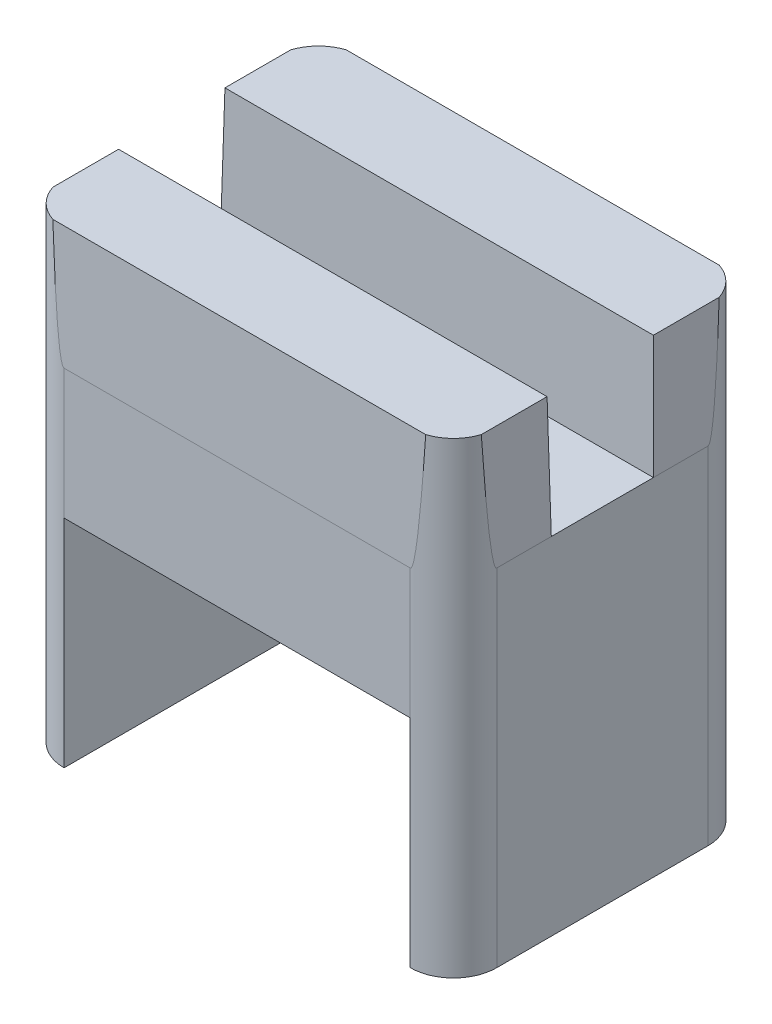
ISO-10303-21;
HEADER;
FILE_DESCRIPTION(('STEP AP214'),'2;1');
FILE_NAME('part.step','',(''),(''),'','','');
FILE_SCHEMA(('AUTOMOTIVE_DESIGN { 1 0 10303 214 1 1 1 1 }'));
ENDSEC;
DATA;
#1=APPLICATION_CONTEXT('core data for automotive mechanical design processes');
#2=APPLICATION_PROTOCOL_DEFINITION('international standard','automotive_design',2000,#1);
#3=PRODUCT_CONTEXT('',#1,'mechanical');
#4=PRODUCT('Part','Part','',(#3));
#5=PRODUCT_RELATED_PRODUCT_CATEGORY('part','',(#4));
#6=PRODUCT_DEFINITION_FORMATION('','',#4);
#7=PRODUCT_DEFINITION_CONTEXT('part definition',#1,'design');
#8=PRODUCT_DEFINITION('design','',#6,#7);
#9=PRODUCT_DEFINITION_SHAPE('','',#8);
#10=(LENGTH_UNIT() NAMED_UNIT(*) SI_UNIT(.MILLI.,.METRE.));
#11=(NAMED_UNIT(*) PLANE_ANGLE_UNIT() SI_UNIT($,.RADIAN.));
#12=(NAMED_UNIT(*) SI_UNIT($,.STERADIAN.) SOLID_ANGLE_UNIT());
#13=UNCERTAINTY_MEASURE_WITH_UNIT(LENGTH_MEASURE(1.E-05),#10,'distance_accuracy_value','');
#14=(GEOMETRIC_REPRESENTATION_CONTEXT(3) GLOBAL_UNCERTAINTY_ASSIGNED_CONTEXT((#13)) GLOBAL_UNIT_ASSIGNED_CONTEXT((#10,
#11,#12)) REPRESENTATION_CONTEXT('',''));
#15=CARTESIAN_POINT('',(0.,0.,0.));
#16=DIRECTION('',(0.,0.,1.));
#17=DIRECTION('',(1.,0.,0.));
#18=AXIS2_PLACEMENT_3D('',#15,#16,#17);
#19=CARTESIAN_POINT('',(0.,40.,34.4));
#20=DIRECTION('',(0.,-1.,0.));
#21=DIRECTION('',(0.,0.,-1.));
#22=AXIS2_PLACEMENT_3D('',#19,#20,#21);
#23=PLANE('',#22);
#24=DIRECTION('',(-1.,0.,0.));
#25=VECTOR('',#24,1.);
#26=CARTESIAN_POINT('',(0.,40.,23.1));
#27=LINE('',#26,#25);
#28=CARTESIAN_POINT('',(50.,40.,23.1));
#29=VERTEX_POINT('',#28);
#30=CARTESIAN_POINT('',(0.,40.,23.1));
#31=VERTEX_POINT('',#30);
#32=EDGE_CURVE('E184',#29,#31,#27,.T.);
#33=ORIENTED_EDGE('',*,*,#32,.F.);
#34=DIRECTION('',(0.,0.,-1.));
#35=VECTOR('',#34,1.);
#36=CARTESIAN_POINT('',(50.,40.,34.4));
#37=LINE('',#36,#35);
#38=CARTESIAN_POINT('',(50.,40.,11.3));
#39=VERTEX_POINT('',#38);
#40=EDGE_CURVE('E246',#29,#39,#37,.T.);
#41=ORIENTED_EDGE('',*,*,#40,.T.);
#42=DIRECTION('',(1.,0.,0.));
#43=VECTOR('',#42,1.);
#44=CARTESIAN_POINT('',(0.,40.,11.3));
#45=LINE('',#44,#43);
#46=CARTESIAN_POINT('',(0.,40.,11.3));
#47=VERTEX_POINT('',#46);
#48=EDGE_CURVE('E200',#47,#39,#45,.T.);
#49=ORIENTED_EDGE('',*,*,#48,.F.);
#50=DIRECTION('',(0.,0.,-1.));
#51=VECTOR('',#50,1.);
#52=CARTESIAN_POINT('',(0.,40.,34.4));
#53=LINE('',#52,#51);
#54=EDGE_CURVE('E235',#31,#47,#53,.T.);
#55=ORIENTED_EDGE('',*,*,#54,.F.);
#56=EDGE_LOOP('',(#33,#41,#49,#55));
#57=FACE_BOUND('',#56,.T.);
#58=ADVANCED_FACE('F41',(#57),#23,.F.);
#59=CARTESIAN_POINT('',(0.,0.,34.4));
#60=DIRECTION('',(1.,0.,0.));
#61=DIRECTION('',(0.,0.,-1.));
#62=AXIS2_PLACEMENT_3D('',#59,#60,#61);
#63=PLANE('',#62);
#64=DIRECTION('',(0.,0.,1.));
#65=VECTOR('',#64,1.);
#66=CARTESIAN_POINT('',(0.,40.,0.));
#67=LINE('',#66,#65);
#68=CARTESIAN_POINT('',(0.,40.,5.));
#69=VERTEX_POINT('',#68);
#70=EDGE_CURVE('E193',#69,#47,#67,.T.);
#71=ORIENTED_EDGE('',*,*,#70,.F.);
#72=DIRECTION('',(0.,-1.,0.));
#73=VECTOR('',#72,1.);
#74=CARTESIAN_POINT('',(0.,0.,5.));
#75=LINE('',#74,#73);
#76=CARTESIAN_POINT('',(0.,0.,5.00000000000001));
#77=VERTEX_POINT('',#76);
#78=EDGE_CURVE('E306',#69,#77,#75,.T.);
#79=ORIENTED_EDGE('',*,*,#78,.T.);
#80=DIRECTION('',(0.,0.,-1.));
#81=VECTOR('',#80,1.);
#82=CARTESIAN_POINT('',(0.,0.,34.4));
#83=LINE('',#82,#81);
#84=CARTESIAN_POINT('',(0.,0.,29.4));
#85=VERTEX_POINT('',#84);
#86=EDGE_CURVE('E264',#85,#77,#83,.T.);
#87=ORIENTED_EDGE('',*,*,#86,.F.);
#88=DIRECTION('',(0.,-1.,0.));
#89=VECTOR('',#88,1.);
#90=CARTESIAN_POINT('',(0.,0.,29.4));
#91=LINE('',#90,#89);
#92=CARTESIAN_POINT('',(0.,40.,29.4));
#93=VERTEX_POINT('',#92);
#94=EDGE_CURVE('E63',#85,#93,#91,.F.);
#95=ORIENTED_EDGE('',*,*,#94,.T.);
#96=EDGE_CURVE('E244',#93,#31,#53,.T.);
#97=ORIENTED_EDGE('',*,*,#96,.T.);
#98=ORIENTED_EDGE('',*,*,#54,.T.);
#99=EDGE_LOOP('',(#71,#79,#87,#95,#97,#98));
#100=FACE_BOUND('',#99,.T.);
#101=ADVANCED_FACE('F360',(#100),#63,.F.);
#102=CARTESIAN_POINT('',(0.,0.,34.4));
#103=DIRECTION('',(0.,1.,0.));
#104=DIRECTION('',(0.,0.,1.));
#105=AXIS2_PLACEMENT_3D('',#102,#103,#104);
#106=PLANE('',#105);
#107=ORIENTED_EDGE('',*,*,#86,.T.);
#108=CARTESIAN_POINT('',(5.,0.,5.));
#109=DIRECTION('',(0.,1.,0.));
#110=DIRECTION('',(0.,0.,1.));
#111=AXIS2_PLACEMENT_3D('',#108,#109,#110);
#112=CIRCLE('',#111,5.);
#113=CARTESIAN_POINT('',(5.,0.,0.));
#114=VERTEX_POINT('',#113);
#115=EDGE_CURVE('E311',#77,#114,#112,.F.);
#116=ORIENTED_EDGE('',*,*,#115,.T.);
#117=DIRECTION('',(0.,0.,-1.));
#118=VECTOR('',#117,1.);
#119=CARTESIAN_POINT('',(5.,0.,34.4));
#120=LINE('',#119,#118);
#121=CARTESIAN_POINT('',(5.,0.,34.4));
#122=VERTEX_POINT('',#121);
#123=EDGE_CURVE('E261',#122,#114,#120,.T.);
#124=ORIENTED_EDGE('',*,*,#123,.F.);
#125=CARTESIAN_POINT('',(5.,0.,29.4));
#126=DIRECTION('',(0.,1.,0.));
#127=DIRECTION('',(0.,0.,1.));
#128=AXIS2_PLACEMENT_3D('',#125,#126,#127);
#129=CIRCLE('',#128,5.);
#130=EDGE_CURVE('E309',#122,#85,#129,.F.);
#131=ORIENTED_EDGE('',*,*,#130,.T.);
#132=EDGE_LOOP('',(#107,#116,#124,#131));
#133=FACE_BOUND('',#132,.T.);
#134=ADVANCED_FACE('F313',(#133),#106,.F.);
#135=CARTESIAN_POINT('',(5.,0.,34.4));
#136=DIRECTION('',(-1.,0.,0.));
#137=DIRECTION('',(0.,0.,1.));
#138=AXIS2_PLACEMENT_3D('',#135,#136,#137);
#139=PLANE('',#138);
#140=DIRECTION('',(0.,1.,0.));
#141=VECTOR('',#140,1.);
#142=CARTESIAN_POINT('',(5.,0.,0.));
#143=LINE('',#142,#141);
#144=CARTESIAN_POINT('',(5.,25.,0.));
#145=VERTEX_POINT('',#144);
#146=EDGE_CURVE('E210',#114,#145,#143,.T.);
#147=ORIENTED_EDGE('',*,*,#146,.T.);
#148=DIRECTION('',(0.,0.,-1.));
#149=VECTOR('',#148,1.);
#150=CARTESIAN_POINT('',(5.,25.,34.4));
#151=LINE('',#150,#149);
#152=CARTESIAN_POINT('',(5.,25.,34.4));
#153=VERTEX_POINT('',#152);
#154=EDGE_CURVE('E258',#153,#145,#151,.T.);
#155=ORIENTED_EDGE('',*,*,#154,.F.);
#156=DIRECTION('',(0.,1.,0.));
#157=VECTOR('',#156,1.);
#158=CARTESIAN_POINT('',(5.,0.,34.4));
#159=LINE('',#158,#157);
#160=EDGE_CURVE('E223',#122,#153,#159,.T.);
#161=ORIENTED_EDGE('',*,*,#160,.F.);
#162=ORIENTED_EDGE('',*,*,#123,.T.);
#163=EDGE_LOOP('',(#147,#155,#161,#162));
#164=FACE_BOUND('',#163,.T.);
#165=ADVANCED_FACE('F319',(#164),#139,.F.);
#166=CARTESIAN_POINT('',(5.,25.,34.4));
#167=DIRECTION('',(0.,1.,0.));
#168=DIRECTION('',(0.,0.,1.));
#169=AXIS2_PLACEMENT_3D('',#166,#167,#168);
#170=PLANE('',#169);
#171=DIRECTION('',(1.,0.,0.));
#172=VECTOR('',#171,1.);
#173=CARTESIAN_POINT('',(5.,25.,0.));
#174=LINE('',#173,#172);
#175=CARTESIAN_POINT('',(45.,25.,0.));
#176=VERTEX_POINT('',#175);
#177=EDGE_CURVE('E237',#145,#176,#174,.T.);
#178=ORIENTED_EDGE('',*,*,#177,.T.);
#179=DIRECTION('',(0.,0.,-1.));
#180=VECTOR('',#179,1.);
#181=CARTESIAN_POINT('',(45.,25.,34.4));
#182=LINE('',#181,#180);
#183=CARTESIAN_POINT('',(45.,25.,34.4));
#184=VERTEX_POINT('',#183);
#185=EDGE_CURVE('E255',#184,#176,#182,.T.);
#186=ORIENTED_EDGE('',*,*,#185,.F.);
#187=DIRECTION('',(1.,0.,0.));
#188=VECTOR('',#187,1.);
#189=CARTESIAN_POINT('',(5.,25.,34.4));
#190=LINE('',#189,#188);
#191=EDGE_CURVE('E225',#153,#184,#190,.T.);
#192=ORIENTED_EDGE('',*,*,#191,.F.);
#193=ORIENTED_EDGE('',*,*,#154,.T.);
#194=EDGE_LOOP('',(#178,#186,#192,#193));
#195=FACE_BOUND('',#194,.T.);
#196=ADVANCED_FACE('F342',(#195),#170,.F.);
#197=CARTESIAN_POINT('',(45.,0.,34.4));
#198=DIRECTION('',(1.,0.,0.));
#199=DIRECTION('',(0.,0.,-1.));
#200=AXIS2_PLACEMENT_3D('',#197,#198,#199);
#201=PLANE('',#200);
#202=DIRECTION('',(0.,-1.,0.));
#203=VECTOR('',#202,1.);
#204=CARTESIAN_POINT('',(45.,0.,0.));
#205=LINE('',#204,#203);
#206=CARTESIAN_POINT('',(45.,0.,0.));
#207=VERTEX_POINT('',#206);
#208=EDGE_CURVE('E240',#176,#207,#205,.T.);
#209=ORIENTED_EDGE('',*,*,#208,.T.);
#210=DIRECTION('',(0.,0.,-1.));
#211=VECTOR('',#210,1.);
#212=CARTESIAN_POINT('',(45.,0.,34.4));
#213=LINE('',#212,#211);
#214=CARTESIAN_POINT('',(45.,0.,34.4));
#215=VERTEX_POINT('',#214);
#216=EDGE_CURVE('E252',#215,#207,#213,.T.);
#217=ORIENTED_EDGE('',*,*,#216,.F.);
#218=DIRECTION('',(0.,-1.,0.));
#219=VECTOR('',#218,1.);
#220=CARTESIAN_POINT('',(45.,0.,34.4));
#221=LINE('',#220,#219);
#222=EDGE_CURVE('E229',#184,#215,#221,.T.);
#223=ORIENTED_EDGE('',*,*,#222,.F.);
#224=ORIENTED_EDGE('',*,*,#185,.T.);
#225=EDGE_LOOP('',(#209,#217,#223,#224));
#226=FACE_BOUND('',#225,.T.);
#227=ADVANCED_FACE('F346',(#226),#201,.F.);
#228=CARTESIAN_POINT('',(45.,0.,34.4));
#229=DIRECTION('',(0.,1.,0.));
#230=DIRECTION('',(0.,0.,1.));
#231=AXIS2_PLACEMENT_3D('',#228,#229,#230);
#232=PLANE('',#231);
#233=DIRECTION('',(0.,0.,-1.));
#234=VECTOR('',#233,1.);
#235=CARTESIAN_POINT('',(50.,0.,34.4));
#236=LINE('',#235,#234);
#237=CARTESIAN_POINT('',(50.,0.,29.4));
#238=VERTEX_POINT('',#237);
#239=CARTESIAN_POINT('',(50.,0.,5.00000000000001));
#240=VERTEX_POINT('',#239);
#241=EDGE_CURVE('E249',#238,#240,#236,.T.);
#242=ORIENTED_EDGE('',*,*,#241,.F.);
#243=CARTESIAN_POINT('',(45.,0.,29.4));
#244=DIRECTION('',(0.,1.,0.));
#245=DIRECTION('',(0.,0.,1.));
#246=AXIS2_PLACEMENT_3D('',#243,#244,#245);
#247=CIRCLE('',#246,5.);
#248=EDGE_CURVE('E289',#238,#215,#247,.F.);
#249=ORIENTED_EDGE('',*,*,#248,.T.);
#250=ORIENTED_EDGE('',*,*,#216,.T.);
#251=CARTESIAN_POINT('',(45.,0.,5.));
#252=DIRECTION('',(0.,1.,0.));
#253=DIRECTION('',(0.,0.,1.));
#254=AXIS2_PLACEMENT_3D('',#251,#252,#253);
#255=CIRCLE('',#254,5.);
#256=EDGE_CURVE('E287',#207,#240,#255,.F.);
#257=ORIENTED_EDGE('',*,*,#256,.T.);
#258=EDGE_LOOP('',(#242,#249,#250,#257));
#259=FACE_BOUND('',#258,.T.);
#260=ADVANCED_FACE('F382',(#259),#232,.F.);
#261=CARTESIAN_POINT('',(50.,0.,34.4));
#262=DIRECTION('',(-1.,0.,0.));
#263=DIRECTION('',(0.,0.,1.));
#264=AXIS2_PLACEMENT_3D('',#261,#262,#263);
#265=PLANE('',#264);
#266=CARTESIAN_POINT('',(50.,40.,29.4));
#267=VERTEX_POINT('',#266);
#268=EDGE_CURVE('E247',#267,#29,#37,.T.);
#269=ORIENTED_EDGE('',*,*,#268,.F.);
#270=DIRECTION('',(0.,1.,0.));
#271=VECTOR('',#270,1.);
#272=CARTESIAN_POINT('',(50.,0.,29.4));
#273=LINE('',#272,#271);
#274=EDGE_CURVE('E285',#267,#238,#273,.F.);
#275=ORIENTED_EDGE('',*,*,#274,.T.);
#276=ORIENTED_EDGE('',*,*,#241,.T.);
#277=DIRECTION('',(0.,1.,0.));
#278=VECTOR('',#277,1.);
#279=CARTESIAN_POINT('',(50.,40.,5.));
#280=LINE('',#279,#278);
#281=CARTESIAN_POINT('',(50.,40.,5.));
#282=VERTEX_POINT('',#281);
#283=EDGE_CURVE('E282',#240,#282,#280,.T.);
#284=ORIENTED_EDGE('',*,*,#283,.T.);
#285=DIRECTION('',(0.,0.,-1.));
#286=VECTOR('',#285,1.);
#287=CARTESIAN_POINT('',(50.,40.,0.));
#288=LINE('',#287,#286);
#289=EDGE_CURVE('E203',#39,#282,#288,.T.);
#290=ORIENTED_EDGE('',*,*,#289,.F.);
#291=ORIENTED_EDGE('',*,*,#40,.F.);
#292=EDGE_LOOP('',(#269,#275,#276,#284,#290,#291));
#293=FACE_BOUND('',#292,.T.);
#294=ADVANCED_FACE('F378',(#293),#265,.F.);
#295=CARTESIAN_POINT('',(0.,0.,34.4));
#296=DIRECTION('',(0.,0.,-1.));
#297=DIRECTION('',(-1.,0.,0.));
#298=AXIS2_PLACEMENT_3D('',#295,#296,#297);
#299=PLANE('',#298);
#300=ORIENTED_EDGE('',*,*,#191,.T.);
#301=DIRECTION('',(0.,1.,0.));
#302=VECTOR('',#301,1.);
#303=CARTESIAN_POINT('',(45.,0.,34.4));
#304=LINE('',#303,#302);
#305=CARTESIAN_POINT('',(45.,40.,34.4));
#306=VERTEX_POINT('',#305);
#307=EDGE_CURVE('E270',#184,#306,#304,.T.);
#308=ORIENTED_EDGE('',*,*,#307,.T.);
#309=DIRECTION('',(-1.,0.,0.));
#310=VECTOR('',#309,1.);
#311=CARTESIAN_POINT('',(0.,40.,34.4));
#312=LINE('',#311,#310);
#313=CARTESIAN_POINT('',(5.,40.,34.4));
#314=VERTEX_POINT('',#313);
#315=EDGE_CURVE('E232',#306,#314,#312,.T.);
#316=ORIENTED_EDGE('',*,*,#315,.T.);
#317=DIRECTION('',(0.,-1.,0.));
#318=VECTOR('',#317,1.);
#319=CARTESIAN_POINT('',(5.,0.,34.4));
#320=LINE('',#319,#318);
#321=EDGE_CURVE('E267',#314,#153,#320,.T.);
#322=ORIENTED_EDGE('',*,*,#321,.T.);
#323=EDGE_LOOP('',(#300,#308,#316,#322));
#324=FACE_BOUND('',#323,.T.);
#325=ADVANCED_FACE('F356',(#324),#299,.F.);
#326=CARTESIAN_POINT('',(0.,0.,0.));
#327=DIRECTION('',(0.,0.,-1.));
#328=DIRECTION('',(-1.,0.,0.));
#329=AXIS2_PLACEMENT_3D('',#326,#327,#328);
#330=PLANE('',#329);
#331=DIRECTION('',(-1.,0.,0.));
#332=VECTOR('',#331,1.);
#333=CARTESIAN_POINT('',(0.,40.,0.));
#334=LINE('',#333,#332);
#335=CARTESIAN_POINT('',(45.,40.,0.));
#336=VERTEX_POINT('',#335);
#337=CARTESIAN_POINT('',(5.,40.,0.));
#338=VERTEX_POINT('',#337);
#339=EDGE_CURVE('E226',#336,#338,#334,.T.);
#340=ORIENTED_EDGE('',*,*,#339,.F.);
#341=DIRECTION('',(0.,1.,0.));
#342=VECTOR('',#341,1.);
#343=CARTESIAN_POINT('',(45.,0.,0.));
#344=LINE('',#343,#342);
#345=EDGE_CURVE('E303',#336,#176,#344,.F.);
#346=ORIENTED_EDGE('',*,*,#345,.T.);
#347=ORIENTED_EDGE('',*,*,#177,.F.);
#348=DIRECTION('',(0.,-1.,0.));
#349=VECTOR('',#348,1.);
#350=CARTESIAN_POINT('',(5.,40.,0.));
#351=LINE('',#350,#349);
#352=EDGE_CURVE('E301',#145,#338,#351,.F.);
#353=ORIENTED_EDGE('',*,*,#352,.T.);
#354=EDGE_LOOP('',(#340,#346,#347,#353));
#355=FACE_BOUND('',#354,.T.);
#356=ADVANCED_FACE('F329',(#355),#330,.T.);
#357=CARTESIAN_POINT('',(0.,40.,0.));
#358=DIRECTION('',(-0.999847695156391,0.0174524064372835,0.));
#359=DIRECTION('',(-0.0174524064372836,-0.999847695156391,0.));
#360=AXIS2_PLACEMENT_3D('',#357,#358,#359);
#361=PLANE('',#360);
#362=DIRECTION('',(0.,0.,-1.));
#363=VECTOR('',#362,1.);
#364=CARTESIAN_POINT('',(0.244370908995047,54.,0.));
#365=LINE('',#364,#363);
#366=CARTESIAN_POINT('',(0.244370908995047,54.,3.45598188197566));
#367=VERTEX_POINT('',#366);
#368=CARTESIAN_POINT('',(0.244370908995048,54.,11.055629091005));
#369=VERTEX_POINT('',#368);
#370=EDGE_CURVE('E206',#367,#369,#365,.F.);
#371=ORIENTED_EDGE('',*,*,#370,.F.);
#372=CARTESIAN_POINT('',(5.,326.449808153796,5.));
#373=DIRECTION('',(-0.999847695156391,0.0174524064372835,0.));
#374=DIRECTION('',(0.0174524064372836,0.999847695156391,0.));
#375=AXIS2_PLACEMENT_3D('',#372,#373,#374);
#376=ELLIPSE('',#375,286.49344249275,5.);
#377=EDGE_CURVE('E49',#367,#69,#376,.T.);
#378=ORIENTED_EDGE('',*,*,#377,.T.);
#379=ORIENTED_EDGE('',*,*,#70,.T.);
#380=DIRECTION('',(-0.0174497491606827,-0.999695459881888,0.0174497491606827));
#381=VECTOR('',#380,1.);
#382=CARTESIAN_POINT('',(0.,40.,11.3));
#383=LINE('',#382,#381);
#384=EDGE_CURVE('E207',#369,#47,#383,.T.);
#385=ORIENTED_EDGE('',*,*,#384,.F.);
#386=EDGE_LOOP('',(#371,#378,#379,#385));
#387=FACE_BOUND('',#386,.T.);
#388=ADVANCED_FACE('F366',(#387),#361,.T.);
#389=CARTESIAN_POINT('',(0.,40.,11.3));
#390=DIRECTION('',(0.,0.0174524064372835,0.999847695156391));
#391=DIRECTION('',(0.,-0.999847695156391,0.0174524064372835));
#392=AXIS2_PLACEMENT_3D('',#389,#390,#391);
#393=PLANE('',#392);
#394=ORIENTED_EDGE('',*,*,#48,.T.);
#395=DIRECTION('',(0.0174497491606827,-0.999695459881888,0.0174497491606827));
#396=VECTOR('',#395,1.);
#397=CARTESIAN_POINT('',(49.9965592206728,40.1971221156357,11.2965592206728));
#398=LINE('',#397,#396);
#399=CARTESIAN_POINT('',(49.755629091005,54.,11.055629091005));
#400=VERTEX_POINT('',#399);
#401=EDGE_CURVE('E211',#400,#39,#398,.T.);
#402=ORIENTED_EDGE('',*,*,#401,.F.);
#403=DIRECTION('',(-1.,0.,0.));
#404=VECTOR('',#403,1.);
#405=CARTESIAN_POINT('',(0.,54.,11.055629091005));
#406=LINE('',#405,#404);
#407=EDGE_CURVE('E216',#369,#400,#406,.F.);
#408=ORIENTED_EDGE('',*,*,#407,.F.);
#409=ORIENTED_EDGE('',*,*,#384,.T.);
#410=EDGE_LOOP('',(#394,#402,#408,#409));
#411=FACE_BOUND('',#410,.T.);
#412=ADVANCED_FACE('F368',(#411),#393,.T.);
#413=CARTESIAN_POINT('',(50.,40.,0.));
#414=DIRECTION('',(0.999847695156391,0.0174524064372835,0.));
#415=DIRECTION('',(-0.0174524064372836,0.999847695156391,0.));
#416=AXIS2_PLACEMENT_3D('',#413,#414,#415);
#417=PLANE('',#416);
#418=ORIENTED_EDGE('',*,*,#289,.T.);
#419=CARTESIAN_POINT('',(45.,326.449808153796,5.));
#420=DIRECTION('',(0.999847695156391,0.0174524064372835,0.));
#421=DIRECTION('',(0.0174524064372836,-0.999847695156391,0.));
#422=AXIS2_PLACEMENT_3D('',#419,#420,#421);
#423=ELLIPSE('',#422,286.49344249275,5.);
#424=CARTESIAN_POINT('',(49.755629091005,54.,3.45598188197566));
#425=VERTEX_POINT('',#424);
#426=EDGE_CURVE('E291',#282,#425,#423,.T.);
#427=ORIENTED_EDGE('',*,*,#426,.T.);
#428=DIRECTION('',(0.,0.,1.));
#429=VECTOR('',#428,1.);
#430=CARTESIAN_POINT('',(49.755629091005,54.,0.));
#431=LINE('',#430,#429);
#432=EDGE_CURVE('E218',#400,#425,#431,.F.);
#433=ORIENTED_EDGE('',*,*,#432,.F.);
#434=ORIENTED_EDGE('',*,*,#401,.T.);
#435=EDGE_LOOP('',(#418,#427,#433,#434));
#436=FACE_BOUND('',#435,.T.);
#437=ADVANCED_FACE('F373',(#436),#417,.T.);
#438=CARTESIAN_POINT('',(0.,40.,0.));
#439=DIRECTION('',(0.,0.0174524064372835,-0.999847695156391));
#440=DIRECTION('',(0.,0.999847695156391,0.0174524064372835));
#441=AXIS2_PLACEMENT_3D('',#438,#439,#440);
#442=PLANE('',#441);
#443=DIRECTION('',(1.,0.,0.));
#444=VECTOR('',#443,1.);
#445=CARTESIAN_POINT('',(0.,54.,0.244370908995047));
#446=LINE('',#445,#444);
#447=CARTESIAN_POINT('',(46.5440181180243,54.,0.244370908995047));
#448=VERTEX_POINT('',#447);
#449=CARTESIAN_POINT('',(3.45598188197567,54.,0.244370908995047));
#450=VERTEX_POINT('',#449);
#451=EDGE_CURVE('E214',#448,#450,#446,.F.);
#452=ORIENTED_EDGE('',*,*,#451,.F.);
#453=CARTESIAN_POINT('',(45.,326.449808153797,5.));
#454=DIRECTION('',(0.,0.0174524064372835,-0.999847695156391));
#455=DIRECTION('',(0.,-0.999847695156391,-0.0174524064372835));
#456=AXIS2_PLACEMENT_3D('',#453,#454,#455);
#457=ELLIPSE('',#456,286.49344249275,5.);
#458=EDGE_CURVE('E299',#448,#336,#457,.T.);
#459=ORIENTED_EDGE('',*,*,#458,.T.);
#460=ORIENTED_EDGE('',*,*,#339,.T.);
#461=CARTESIAN_POINT('',(5.,326.449808153797,5.));
#462=DIRECTION('',(0.,0.0174524064372835,-0.999847695156391));
#463=DIRECTION('',(0.,0.999847695156391,0.0174524064372835));
#464=AXIS2_PLACEMENT_3D('',#461,#462,#463);
#465=ELLIPSE('',#464,286.49344249275,5.);
#466=EDGE_CURVE('E297',#338,#450,#465,.T.);
#467=ORIENTED_EDGE('',*,*,#466,.T.);
#468=EDGE_LOOP('',(#452,#459,#460,#467));
#469=FACE_BOUND('',#468,.T.);
#470=ADVANCED_FACE('F333',(#469),#442,.T.);
#471=CARTESIAN_POINT('',(0.,54.,0.));
#472=DIRECTION('',(0.,1.,0.));
#473=DIRECTION('',(0.,0.,1.));
#474=AXIS2_PLACEMENT_3D('',#471,#472,#473);
#475=PLANE('',#474);
#476=ORIENTED_EDGE('',*,*,#432,.T.);
#477=CARTESIAN_POINT('',(45.,54.,5.));
#478=DIRECTION('',(0.,1.,0.));
#479=DIRECTION('',(0.,0.,1.));
#480=AXIS2_PLACEMENT_3D('',#477,#478,#479);
#481=CIRCLE('',#480,5.);
#482=EDGE_CURVE('E295',#425,#448,#481,.T.);
#483=ORIENTED_EDGE('',*,*,#482,.T.);
#484=ORIENTED_EDGE('',*,*,#451,.T.);
#485=CARTESIAN_POINT('',(5.,54.,5.));
#486=DIRECTION('',(0.,1.,0.));
#487=DIRECTION('',(0.,0.,1.));
#488=AXIS2_PLACEMENT_3D('',#485,#486,#487);
#489=CIRCLE('',#488,5.);
#490=EDGE_CURVE('E293',#450,#367,#489,.T.);
#491=ORIENTED_EDGE('',*,*,#490,.T.);
#492=ORIENTED_EDGE('',*,*,#370,.T.);
#493=ORIENTED_EDGE('',*,*,#407,.T.);
#494=EDGE_LOOP('',(#476,#483,#484,#491,#492,#493));
#495=FACE_BOUND('',#494,.T.);
#496=ADVANCED_FACE('F363',(#495),#475,.T.);
#497=CARTESIAN_POINT('',(0.,40.,34.4));
#498=DIRECTION('',(-0.999847695156391,0.0174524064372835,0.));
#499=DIRECTION('',(-0.0174524064372836,-0.999847695156391,0.));
#500=AXIS2_PLACEMENT_3D('',#497,#498,#499);
#501=PLANE('',#500);
#502=ORIENTED_EDGE('',*,*,#96,.F.);
#503=CARTESIAN_POINT('',(5.,326.449808153796,29.4));
#504=DIRECTION('',(-0.999847695156391,0.0174524064372835,0.));
#505=DIRECTION('',(-0.0174524064372836,-0.999847695156391,0.));
#506=AXIS2_PLACEMENT_3D('',#503,#504,#505);
#507=ELLIPSE('',#506,286.49344249275,5.);
#508=CARTESIAN_POINT('',(0.244370908995047,54.,30.9440181180243));
#509=VERTEX_POINT('',#508);
#510=EDGE_CURVE('E11',#93,#509,#507,.T.);
#511=ORIENTED_EDGE('',*,*,#510,.T.);
#512=DIRECTION('',(0.,0.,-1.));
#513=VECTOR('',#512,1.);
#514=CARTESIAN_POINT('',(0.244370908995047,54.,0.));
#515=LINE('',#514,#513);
#516=CARTESIAN_POINT('',(0.244370908995047,54.,23.344370908995));
#517=VERTEX_POINT('',#516);
#518=EDGE_CURVE('E171',#517,#509,#515,.F.);
#519=ORIENTED_EDGE('',*,*,#518,.F.);
#520=DIRECTION('',(-0.0174497491606827,-0.999695459881888,-0.0174497491606827));
#521=VECTOR('',#520,1.);
#522=CARTESIAN_POINT('',(0.00344077932720945,40.1971221156357,23.1034407793272));
#523=LINE('',#522,#521);
#524=EDGE_CURVE('E178',#517,#31,#523,.T.);
#525=ORIENTED_EDGE('',*,*,#524,.T.);
#526=EDGE_LOOP('',(#502,#511,#519,#525));
#527=FACE_BOUND('',#526,.T.);
#528=ADVANCED_FACE('F189',(#527),#501,.T.);
#529=CARTESIAN_POINT('',(0.,40.,34.4));
#530=DIRECTION('',(0.,0.0174524064372835,0.999847695156391));
#531=DIRECTION('',(0.,-0.999847695156391,0.0174524064372835));
#532=AXIS2_PLACEMENT_3D('',#529,#530,#531);
#533=PLANE('',#532);
#534=ORIENTED_EDGE('',*,*,#315,.F.);
#535=CARTESIAN_POINT('',(45.,326.449808153797,29.4));
#536=DIRECTION('',(0.,0.0174524064372835,0.999847695156391));
#537=DIRECTION('',(0.,0.999847695156391,-0.0174524064372835));
#538=AXIS2_PLACEMENT_3D('',#535,#536,#537);
#539=ELLIPSE('',#538,286.49344249275,5.);
#540=CARTESIAN_POINT('',(46.5440181180244,54.,34.1556290910049));
#541=VERTEX_POINT('',#540);
#542=EDGE_CURVE('E274',#306,#541,#539,.T.);
#543=ORIENTED_EDGE('',*,*,#542,.T.);
#544=DIRECTION('',(-1.,0.,0.));
#545=VECTOR('',#544,1.);
#546=CARTESIAN_POINT('',(0.,54.,34.1556290910049));
#547=LINE('',#546,#545);
#548=CARTESIAN_POINT('',(3.45598188197567,54.,34.1556290910049));
#549=VERTEX_POINT('',#548);
#550=EDGE_CURVE('E191',#549,#541,#547,.F.);
#551=ORIENTED_EDGE('',*,*,#550,.F.);
#552=CARTESIAN_POINT('',(5.,326.449808153797,29.4));
#553=DIRECTION('',(0.,0.0174524064372835,0.999847695156391));
#554=DIRECTION('',(0.,-0.999847695156391,0.0174524064372835));
#555=AXIS2_PLACEMENT_3D('',#552,#553,#554);
#556=ELLIPSE('',#555,286.49344249275,5.);
#557=EDGE_CURVE('E272',#549,#314,#556,.T.);
#558=ORIENTED_EDGE('',*,*,#557,.T.);
#559=EDGE_LOOP('',(#534,#543,#551,#558));
#560=FACE_BOUND('',#559,.T.);
#561=ADVANCED_FACE('F417',(#560),#533,.T.);
#562=CARTESIAN_POINT('',(50.,40.,34.4));
#563=DIRECTION('',(0.999847695156391,0.0174524064372835,0.));
#564=DIRECTION('',(-0.0174524064372836,0.999847695156391,0.));
#565=AXIS2_PLACEMENT_3D('',#562,#563,#564);
#566=PLANE('',#565);
#567=DIRECTION('',(0.,0.,1.));
#568=VECTOR('',#567,1.);
#569=CARTESIAN_POINT('',(49.7556290910049,54.,0.));
#570=LINE('',#569,#568);
#571=CARTESIAN_POINT('',(49.7556290910049,54.,30.9440181180243));
#572=VERTEX_POINT('',#571);
#573=CARTESIAN_POINT('',(49.755629091005,54.,23.344370908995));
#574=VERTEX_POINT('',#573);
#575=EDGE_CURVE('E174',#572,#574,#570,.F.);
#576=ORIENTED_EDGE('',*,*,#575,.F.);
#577=CARTESIAN_POINT('',(45.,326.449808153796,29.4));
#578=DIRECTION('',(0.999847695156391,0.0174524064372835,0.));
#579=DIRECTION('',(-0.0174524064372836,0.999847695156391,0.));
#580=AXIS2_PLACEMENT_3D('',#577,#578,#579);
#581=ELLIPSE('',#580,286.49344249275,5.);
#582=EDGE_CURVE('E280',#572,#267,#581,.T.);
#583=ORIENTED_EDGE('',*,*,#582,.T.);
#584=ORIENTED_EDGE('',*,*,#268,.T.);
#585=DIRECTION('',(0.0174497491606827,-0.999695459881888,-0.0174497491606827));
#586=VECTOR('',#585,1.);
#587=CARTESIAN_POINT('',(49.9847753127115,40.8722217506006,23.1152246872885));
#588=LINE('',#587,#586);
#589=EDGE_CURVE('E187',#574,#29,#588,.T.);
#590=ORIENTED_EDGE('',*,*,#589,.F.);
#591=EDGE_LOOP('',(#576,#583,#584,#590));
#592=FACE_BOUND('',#591,.T.);
#593=ADVANCED_FACE('F420',(#592),#566,.T.);
#594=CARTESIAN_POINT('',(0.,40.,23.1));
#595=DIRECTION('',(0.,0.0174524064372835,-0.999847695156391));
#596=DIRECTION('',(0.,0.999847695156391,0.0174524064372835));
#597=AXIS2_PLACEMENT_3D('',#594,#595,#596);
#598=PLANE('',#597);
#599=ORIENTED_EDGE('',*,*,#32,.T.);
#600=ORIENTED_EDGE('',*,*,#524,.F.);
#601=DIRECTION('',(1.,0.,0.));
#602=VECTOR('',#601,1.);
#603=CARTESIAN_POINT('',(0.,54.,23.344370908995));
#604=LINE('',#603,#602);
#605=EDGE_CURVE('E166',#574,#517,#604,.F.);
#606=ORIENTED_EDGE('',*,*,#605,.F.);
#607=ORIENTED_EDGE('',*,*,#589,.T.);
#608=EDGE_LOOP('',(#599,#600,#606,#607));
#609=FACE_BOUND('',#608,.T.);
#610=ADVANCED_FACE('F182',(#609),#598,.T.);
#611=CARTESIAN_POINT('',(0.,54.,0.));
#612=DIRECTION('',(0.,-1.,0.));
#613=DIRECTION('',(0.,0.,-1.));
#614=AXIS2_PLACEMENT_3D('',#611,#612,#613);
#615=PLANE('',#614);
#616=ORIENTED_EDGE('',*,*,#550,.T.);
#617=CARTESIAN_POINT('',(45.,54.,29.4));
#618=DIRECTION('',(0.,-1.,0.));
#619=DIRECTION('',(0.,0.,-1.));
#620=AXIS2_PLACEMENT_3D('',#617,#618,#619);
#621=CIRCLE('',#620,5.);
#622=EDGE_CURVE('E278',#541,#572,#621,.F.);
#623=ORIENTED_EDGE('',*,*,#622,.T.);
#624=ORIENTED_EDGE('',*,*,#575,.T.);
#625=ORIENTED_EDGE('',*,*,#605,.T.);
#626=ORIENTED_EDGE('',*,*,#518,.T.);
#627=CARTESIAN_POINT('',(5.,54.,29.4));
#628=DIRECTION('',(0.,-1.,0.));
#629=DIRECTION('',(0.,0.,-1.));
#630=AXIS2_PLACEMENT_3D('',#627,#628,#629);
#631=CIRCLE('',#630,5.);
#632=EDGE_CURVE('E276',#509,#549,#631,.F.);
#633=ORIENTED_EDGE('',*,*,#632,.T.);
#634=EDGE_LOOP('',(#616,#623,#624,#625,#626,#633));
#635=FACE_BOUND('',#634,.T.);
#636=ADVANCED_FACE('F169',(#635),#615,.F.);
#637=CARTESIAN_POINT('',(45.,0.,29.4));
#638=DIRECTION('',(0.,1.,0.));
#639=DIRECTION('',(0.,0.,1.));
#640=AXIS2_PLACEMENT_3D('',#637,#638,#639);
#641=CYLINDRICAL_SURFACE('',#640,5.);
#642=ORIENTED_EDGE('',*,*,#248,.F.);
#643=ORIENTED_EDGE('',*,*,#274,.F.);
#644=ORIENTED_EDGE('',*,*,#582,.F.);
#645=ORIENTED_EDGE('',*,*,#622,.F.);
#646=ORIENTED_EDGE('',*,*,#542,.F.);
#647=ORIENTED_EDGE('',*,*,#307,.F.);
#648=ORIENTED_EDGE('',*,*,#222,.T.);
#649=EDGE_LOOP('',(#642,#643,#644,#645,#646,#647,#648));
#650=FACE_BOUND('',#649,.T.);
#651=ADVANCED_FACE('F350',(#650),#641,.T.);
#652=CARTESIAN_POINT('',(45.,0.,5.));
#653=DIRECTION('',(0.,-1.,0.));
#654=DIRECTION('',(0.,0.,-1.));
#655=AXIS2_PLACEMENT_3D('',#652,#653,#654);
#656=CYLINDRICAL_SURFACE('',#655,5.);
#657=ORIENTED_EDGE('',*,*,#208,.F.);
#658=ORIENTED_EDGE('',*,*,#345,.F.);
#659=ORIENTED_EDGE('',*,*,#458,.F.);
#660=ORIENTED_EDGE('',*,*,#482,.F.);
#661=ORIENTED_EDGE('',*,*,#426,.F.);
#662=ORIENTED_EDGE('',*,*,#283,.F.);
#663=ORIENTED_EDGE('',*,*,#256,.F.);
#664=EDGE_LOOP('',(#657,#658,#659,#660,#661,#662,#663));
#665=FACE_BOUND('',#664,.T.);
#666=ADVANCED_FACE('F338',(#665),#656,.T.);
#667=CARTESIAN_POINT('',(5.,0.,5.));
#668=DIRECTION('',(0.,1.,0.));
#669=DIRECTION('',(0.,0.,1.));
#670=AXIS2_PLACEMENT_3D('',#667,#668,#669);
#671=CYLINDRICAL_SURFACE('',#670,5.);
#672=ORIENTED_EDGE('',*,*,#352,.F.);
#673=ORIENTED_EDGE('',*,*,#146,.F.);
#674=ORIENTED_EDGE('',*,*,#115,.F.);
#675=ORIENTED_EDGE('',*,*,#78,.F.);
#676=ORIENTED_EDGE('',*,*,#377,.F.);
#677=ORIENTED_EDGE('',*,*,#490,.F.);
#678=ORIENTED_EDGE('',*,*,#466,.F.);
#679=EDGE_LOOP('',(#672,#673,#674,#675,#676,#677,#678));
#680=FACE_BOUND('',#679,.T.);
#681=ADVANCED_FACE('F323',(#680),#671,.T.);
#682=CARTESIAN_POINT('',(5.,0.,29.4));
#683=DIRECTION('',(0.,-1.,0.));
#684=DIRECTION('',(0.,0.,-1.));
#685=AXIS2_PLACEMENT_3D('',#682,#683,#684);
#686=CYLINDRICAL_SURFACE('',#685,5.);
#687=ORIENTED_EDGE('',*,*,#510,.F.);
#688=ORIENTED_EDGE('',*,*,#94,.F.);
#689=ORIENTED_EDGE('',*,*,#130,.F.);
#690=ORIENTED_EDGE('',*,*,#160,.T.);
#691=ORIENTED_EDGE('',*,*,#321,.F.);
#692=ORIENTED_EDGE('',*,*,#557,.F.);
#693=ORIENTED_EDGE('',*,*,#632,.F.);
#694=EDGE_LOOP('',(#687,#688,#689,#690,#691,#692,#693));
#695=FACE_BOUND('',#694,.T.);
#696=ADVANCED_FACE('F43',(#695),#686,.T.);
#697=CLOSED_SHELL('',(#58,#101,#134,#165,#196,#227,#260,#294,#325,#356,#388,#412,#437,#470,#496,
#528,#561,#593,#610,#636,#651,#666,#681,#696));
#698=MANIFOLD_SOLID_BREP('B2',#697);
#699=ADVANCED_BREP_SHAPE_REPRESENTATION('',(#18,#698),#14);
#700=SHAPE_DEFINITION_REPRESENTATION(#9,#699);
ENDSEC;
END-ISO-10303-21;
